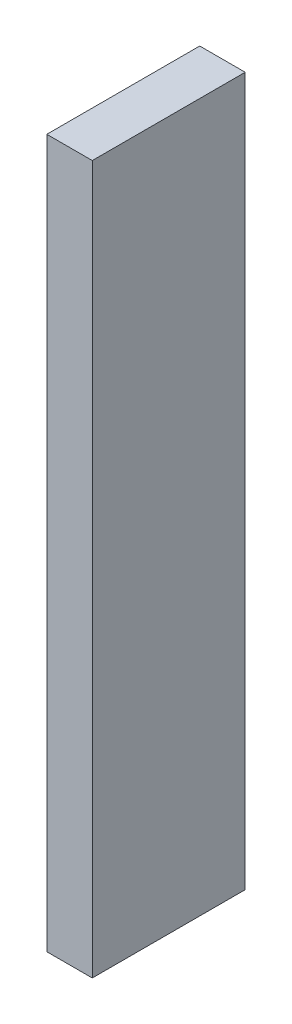
ISO-10303-21;
HEADER;
FILE_DESCRIPTION(('STEP AP214'),'2;1');
FILE_NAME('part.step','',(''),(''),'','','');
FILE_SCHEMA(('AUTOMOTIVE_DESIGN { 1 0 10303 214 1 1 1 1 }'));
ENDSEC;
DATA;
#1=APPLICATION_CONTEXT('core data for automotive mechanical design processes');
#2=APPLICATION_PROTOCOL_DEFINITION('international standard','automotive_design',2000,#1);
#3=PRODUCT_CONTEXT('',#1,'mechanical');
#4=PRODUCT('Part','Part','',(#3));
#5=PRODUCT_RELATED_PRODUCT_CATEGORY('part','',(#4));
#6=PRODUCT_DEFINITION_FORMATION('','',#4);
#7=PRODUCT_DEFINITION_CONTEXT('part definition',#1,'design');
#8=PRODUCT_DEFINITION('design','',#6,#7);
#9=PRODUCT_DEFINITION_SHAPE('','',#8);
#10=(LENGTH_UNIT() NAMED_UNIT(*) SI_UNIT(.MILLI.,.METRE.));
#11=(NAMED_UNIT(*) PLANE_ANGLE_UNIT() SI_UNIT($,.RADIAN.));
#12=(NAMED_UNIT(*) SI_UNIT($,.STERADIAN.) SOLID_ANGLE_UNIT());
#13=UNCERTAINTY_MEASURE_WITH_UNIT(LENGTH_MEASURE(1.E-05),#10,'distance_accuracy_value','');
#14=(GEOMETRIC_REPRESENTATION_CONTEXT(3) GLOBAL_UNCERTAINTY_ASSIGNED_CONTEXT((#13)) GLOBAL_UNIT_ASSIGNED_CONTEXT((#10,
#11,#12)) REPRESENTATION_CONTEXT('',''));
#15=CARTESIAN_POINT('',(0.,0.,0.));
#16=DIRECTION('',(0.,0.,1.));
#17=DIRECTION('',(1.,0.,0.));
#18=AXIS2_PLACEMENT_3D('',#15,#16,#17);
#19=CARTESIAN_POINT('',(130.275545187092,22.4180708263693,101.072024477607));
#20=DIRECTION('',(-1.69244514382854E-09,0.,1.));
#21=DIRECTION('',(1.,0.,1.69244514382854E-09));
#22=AXIS2_PLACEMENT_3D('',#19,#20,#21);
#23=PLANE('',#22);
#24=DIRECTION('',(0.,-1.,0.));
#25=VECTOR('',#24,1.);
#26=CARTESIAN_POINT('',(131.258630284105,22.4180708263693,101.072024479271));
#27=LINE('',#26,#25);
#28=CARTESIAN_POINT('',(131.258630284105,22.4180708263693,101.072024479271));
#29=VERTEX_POINT('',#28);
#30=CARTESIAN_POINT('',(131.258630284105,7.11212965552236,101.072024479271));
#31=VERTEX_POINT('',#30);
#32=EDGE_CURVE('E79',#29,#31,#27,.T.);
#33=ORIENTED_EDGE('',*,*,#32,.F.);
#34=DIRECTION('',(1.,0.,1.69244514382854E-09));
#35=VECTOR('',#34,1.);
#36=CARTESIAN_POINT('',(130.275545187092,22.4180708263693,101.072024477607));
#37=LINE('',#36,#35);
#38=CARTESIAN_POINT('',(130.275545187092,22.4180708263693,101.072024477607));
#39=VERTEX_POINT('',#38);
#40=EDGE_CURVE('E32',#39,#29,#37,.T.);
#41=ORIENTED_EDGE('',*,*,#40,.F.);
#42=DIRECTION('',(0.,-1.,0.));
#43=VECTOR('',#42,1.);
#44=CARTESIAN_POINT('',(130.275545187092,22.4180708263693,101.072024477607));
#45=LINE('',#44,#43);
#46=CARTESIAN_POINT('',(130.275545187092,7.11212965552236,101.072024477607));
#47=VERTEX_POINT('',#46);
#48=EDGE_CURVE('E71',#39,#47,#45,.T.);
#49=ORIENTED_EDGE('',*,*,#48,.T.);
#50=DIRECTION('',(1.,0.,1.69244514382854E-09));
#51=VECTOR('',#50,1.);
#52=CARTESIAN_POINT('',(130.275545187092,7.11212965552236,101.072024477607));
#53=LINE('',#52,#51);
#54=EDGE_CURVE('E10',#47,#31,#53,.T.);
#55=ORIENTED_EDGE('',*,*,#54,.T.);
#56=EDGE_LOOP('',(#33,#41,#49,#55));
#57=FACE_BOUND('',#56,.T.);
#58=ADVANCED_FACE('F16',(#57),#23,.T.);
#59=CARTESIAN_POINT('',(130.275545187092,7.11212965552236,101.072024477607));
#60=DIRECTION('',(0.,-1.,0.));
#61=DIRECTION('',(0.,0.,-1.));
#62=AXIS2_PLACEMENT_3D('',#59,#60,#61);
#63=PLANE('',#62);
#64=DIRECTION('',(1.69244514382854E-09,0.,-1.));
#65=VECTOR('',#64,1.);
#66=CARTESIAN_POINT('',(131.258630284105,7.11212965552236,101.072024479271));
#67=LINE('',#66,#65);
#68=CARTESIAN_POINT('',(131.2586302897,7.11212965552235,97.7660833084218));
#69=VERTEX_POINT('',#68);
#70=EDGE_CURVE('E82',#31,#69,#67,.T.);
#71=ORIENTED_EDGE('',*,*,#70,.F.);
#72=ORIENTED_EDGE('',*,*,#54,.F.);
#73=DIRECTION('',(1.69244514382854E-09,0.,-1.));
#74=VECTOR('',#73,1.);
#75=CARTESIAN_POINT('',(130.275545187092,7.11212965552236,101.072024477607));
#76=LINE('',#75,#74);
#77=CARTESIAN_POINT('',(130.275545192687,7.11212965552235,97.7660833067579));
#78=VERTEX_POINT('',#77);
#79=EDGE_CURVE('E67',#47,#78,#76,.T.);
#80=ORIENTED_EDGE('',*,*,#79,.T.);
#81=DIRECTION('',(1.,0.,1.69244514382854E-09));
#82=VECTOR('',#81,1.);
#83=CARTESIAN_POINT('',(130.275545192687,7.11212965552235,97.7660833067579));
#84=LINE('',#83,#82);
#85=EDGE_CURVE('E24',#78,#69,#84,.T.);
#86=ORIENTED_EDGE('',*,*,#85,.T.);
#87=EDGE_LOOP('',(#71,#72,#80,#86));
#88=FACE_BOUND('',#87,.T.);
#89=ADVANCED_FACE('F68',(#88),#63,.T.);
#90=CARTESIAN_POINT('',(130.275545192687,7.11212965552235,97.7660833067579));
#91=DIRECTION('',(1.69244514382854E-09,0.,-1.));
#92=DIRECTION('',(-1.,0.,-1.69244514382854E-09));
#93=AXIS2_PLACEMENT_3D('',#90,#91,#92);
#94=PLANE('',#93);
#95=DIRECTION('',(0.,1.,0.));
#96=VECTOR('',#95,1.);
#97=CARTESIAN_POINT('',(131.2586302897,7.11212965552235,97.7660833084218));
#98=LINE('',#97,#96);
#99=CARTESIAN_POINT('',(131.2586302897,22.418070826371,97.7660832999612));
#100=VERTEX_POINT('',#99);
#101=EDGE_CURVE('E65',#69,#100,#98,.T.);
#102=ORIENTED_EDGE('',*,*,#101,.F.);
#103=ORIENTED_EDGE('',*,*,#85,.F.);
#104=DIRECTION('',(0.,1.,0.));
#105=VECTOR('',#104,1.);
#106=CARTESIAN_POINT('',(130.275545192687,7.11212965552235,97.7660833067579));
#107=LINE('',#106,#105);
#108=CARTESIAN_POINT('',(130.275545192687,22.418070826371,97.7660832982974));
#109=VERTEX_POINT('',#108);
#110=EDGE_CURVE('E62',#78,#109,#107,.T.);
#111=ORIENTED_EDGE('',*,*,#110,.T.);
#112=DIRECTION('',(1.,0.,1.69244514382854E-09));
#113=VECTOR('',#112,1.);
#114=CARTESIAN_POINT('',(130.275545192687,22.418070826371,97.7660832982974));
#115=LINE('',#114,#113);
#116=EDGE_CURVE('E48',#109,#100,#115,.T.);
#117=ORIENTED_EDGE('',*,*,#116,.T.);
#118=EDGE_LOOP('',(#102,#103,#111,#117));
#119=FACE_BOUND('',#118,.T.);
#120=ADVANCED_FACE('F60',(#119),#94,.T.);
#121=CARTESIAN_POINT('',(130.275545192687,22.418070826371,97.7660832982974));
#122=DIRECTION('',(0.,1.,0.));
#123=DIRECTION('',(-1.,0.,0.));
#124=AXIS2_PLACEMENT_3D('',#121,#122,#123);
#125=PLANE('',#124);
#126=DIRECTION('',(-1.69244514382854E-09,0.,1.));
#127=VECTOR('',#126,1.);
#128=CARTESIAN_POINT('',(131.2586302897,22.418070826371,97.7660832999612));
#129=LINE('',#128,#127);
#130=EDGE_CURVE('E85',#100,#29,#129,.T.);
#131=ORIENTED_EDGE('',*,*,#130,.F.);
#132=ORIENTED_EDGE('',*,*,#116,.F.);
#133=DIRECTION('',(-1.69244514382854E-09,0.,1.));
#134=VECTOR('',#133,1.);
#135=CARTESIAN_POINT('',(130.275545192687,22.418070826371,97.7660832982974));
#136=LINE('',#135,#134);
#137=EDGE_CURVE('E74',#109,#39,#136,.T.);
#138=ORIENTED_EDGE('',*,*,#137,.T.);
#139=ORIENTED_EDGE('',*,*,#40,.T.);
#140=EDGE_LOOP('',(#131,#132,#138,#139));
#141=FACE_BOUND('',#140,.T.);
#142=ADVANCED_FACE('F96',(#141),#125,.T.);
#143=CARTESIAN_POINT('',(130.275545201028,17.2651002409467,92.8378607087388));
#144=DIRECTION('',(1.,0.,1.69244514382854E-09));
#145=DIRECTION('',(0.,1.,0.));
#146=AXIS2_PLACEMENT_3D('',#143,#144,#145);
#147=PLANE('',#146);
#148=ORIENTED_EDGE('',*,*,#48,.F.);
#149=ORIENTED_EDGE('',*,*,#137,.F.);
#150=ORIENTED_EDGE('',*,*,#110,.F.);
#151=ORIENTED_EDGE('',*,*,#79,.F.);
#152=EDGE_LOOP('',(#148,#149,#150,#151));
#153=FACE_BOUND('',#152,.T.);
#154=ADVANCED_FACE('F73',(#153),#147,.F.);
#155=CARTESIAN_POINT('',(131.258630298041,17.2651002409467,92.8378607104026));
#156=DIRECTION('',(1.,0.,1.69244514382854E-09));
#157=DIRECTION('',(0.,1.,0.));
#158=AXIS2_PLACEMENT_3D('',#155,#156,#157);
#159=PLANE('',#158);
#160=ORIENTED_EDGE('',*,*,#32,.T.);
#161=ORIENTED_EDGE('',*,*,#70,.T.);
#162=ORIENTED_EDGE('',*,*,#101,.T.);
#163=ORIENTED_EDGE('',*,*,#130,.T.);
#164=EDGE_LOOP('',(#160,#161,#162,#163));
#165=FACE_BOUND('',#164,.T.);
#166=ADVANCED_FACE('F89',(#165),#159,.T.);
#167=CLOSED_SHELL('',(#58,#89,#120,#142,#154,#166));
#168=MANIFOLD_SOLID_BREP('B1',#167);
#169=ADVANCED_BREP_SHAPE_REPRESENTATION('',(#18,#168),#14);
#170=SHAPE_DEFINITION_REPRESENTATION(#9,#169);
ENDSEC;
END-ISO-10303-21;
